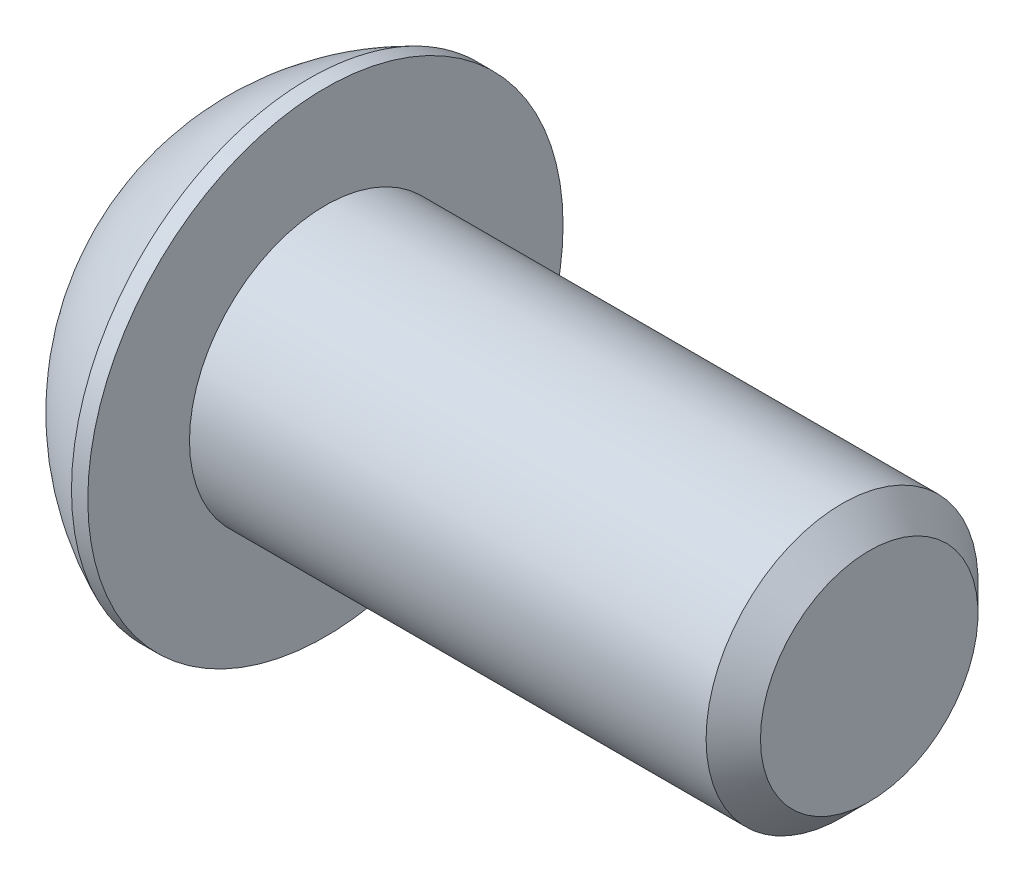
ISO-10303-21;
HEADER;
FILE_DESCRIPTION(('STEP AP214'),'2;1');
FILE_NAME('part.step','',(''),(''),'','','');
FILE_SCHEMA(('AUTOMOTIVE_DESIGN { 1 0 10303 214 1 1 1 1 }'));
ENDSEC;
DATA;
#1=APPLICATION_CONTEXT('core data for automotive mechanical design processes');
#2=APPLICATION_PROTOCOL_DEFINITION('international standard','automotive_design',2000,#1);
#3=PRODUCT_CONTEXT('',#1,'mechanical');
#4=PRODUCT('Part','Part','',(#3));
#5=PRODUCT_RELATED_PRODUCT_CATEGORY('part','',(#4));
#6=PRODUCT_DEFINITION_FORMATION('','',#4);
#7=PRODUCT_DEFINITION_CONTEXT('part definition',#1,'design');
#8=PRODUCT_DEFINITION('design','',#6,#7);
#9=PRODUCT_DEFINITION_SHAPE('','',#8);
#10=(LENGTH_UNIT() NAMED_UNIT(*) SI_UNIT(.MILLI.,.METRE.));
#11=(NAMED_UNIT(*) PLANE_ANGLE_UNIT() SI_UNIT($,.RADIAN.));
#12=(NAMED_UNIT(*) SI_UNIT($,.STERADIAN.) SOLID_ANGLE_UNIT());
#13=UNCERTAINTY_MEASURE_WITH_UNIT(LENGTH_MEASURE(1.E-05),#10,'distance_accuracy_value','');
#14=(GEOMETRIC_REPRESENTATION_CONTEXT(3) GLOBAL_UNCERTAINTY_ASSIGNED_CONTEXT((#13)) GLOBAL_UNIT_ASSIGNED_CONTEXT((#10,
#11,#12)) REPRESENTATION_CONTEXT('',''));
#15=CARTESIAN_POINT('',(0.,0.,0.));
#16=DIRECTION('',(0.,0.,1.));
#17=DIRECTION('',(1.,0.,0.));
#18=AXIS2_PLACEMENT_3D('',#15,#16,#17);
#19=CARTESIAN_POINT('',(1.32080000000034,0.,0.));
#20=DIRECTION('',(-1.,0.,0.));
#21=DIRECTION('',(0.,0.,1.));
#22=AXIS2_PLACEMENT_3D('',#19,#20,#21);
#23=CONICAL_SURFACE('',#22,1.1937999999998,1.04719755119608);
#24=CARTESIAN_POINT('',(2.01004075135902,0.,-4.44089209850063E-13));
#25=VERTEX_POINT('',#24);
#26=VERTEX_LOOP('',#25);
#27=FACE_BOUND('',#26,.T.);
#28=CARTESIAN_POINT('',(1.32080000000009,0.,0.));
#29=DIRECTION('',(-1.,0.,0.));
#30=DIRECTION('',(0.,0.,1.));
#31=AXIS2_PLACEMENT_3D('',#28,#29,#30);
#32=CIRCLE('',#31,1.19380000000024);
#33=CARTESIAN_POINT('',(1.32080000000009,0.,1.19380000000024));
#34=VERTEX_POINT('',#33);
#35=EDGE_CURVE('E21',#34,#34,#32,.T.);
#36=ORIENTED_EDGE('',*,*,#35,.T.);
#37=EDGE_LOOP('',(#36));
#38=FACE_BOUND('',#37,.T.);
#39=ADVANCED_FACE('F18',(#27,#38),#23,.F.);
#40=CARTESIAN_POINT('',(1.3208,-2.29135888084633,0.));
#41=DIRECTION('',(1.,0.,0.));
#42=DIRECTION('',(0.,0.,-1.));
#43=AXIS2_PLACEMENT_3D('',#40,#41,#42);
#44=PLANE('',#43);
#45=DIRECTION('',(0.,1.,0.));
#46=VECTOR('',#45,1.);
#47=CARTESIAN_POINT('',(1.3208,-1.14567944042316,1.984375));
#48=LINE('',#47,#46);
#49=CARTESIAN_POINT('',(1.3208,1.14567944042316,1.984375));
#50=VERTEX_POINT('',#49);
#51=CARTESIAN_POINT('',(1.3208,-1.14567944042316,1.984375));
#52=VERTEX_POINT('',#51);
#53=EDGE_CURVE('E70',#50,#52,#48,.F.);
#54=ORIENTED_EDGE('',*,*,#53,.F.);
#55=DIRECTION('',(0.,0.5,-0.866025403784439));
#56=VECTOR('',#55,1.);
#57=CARTESIAN_POINT('',(1.3208,1.14567944042316,1.984375));
#58=LINE('',#57,#56);
#59=CARTESIAN_POINT('',(1.3208,2.29135888084633,0.));
#60=VERTEX_POINT('',#59);
#61=EDGE_CURVE('E258',#60,#50,#58,.F.);
#62=ORIENTED_EDGE('',*,*,#61,.F.);
#63=DIRECTION('',(0.,-0.5,-0.866025403784439));
#64=VECTOR('',#63,1.);
#65=CARTESIAN_POINT('',(1.3208,2.29135888084633,0.));
#66=LINE('',#65,#64);
#67=CARTESIAN_POINT('',(1.3208,1.14567944042316,-1.984375));
#68=VERTEX_POINT('',#67);
#69=EDGE_CURVE('E262',#68,#60,#66,.F.);
#70=ORIENTED_EDGE('',*,*,#69,.F.);
#71=DIRECTION('',(0.,1.,0.));
#72=VECTOR('',#71,1.);
#73=CARTESIAN_POINT('',(1.3208,1.14567944042316,-1.984375));
#74=LINE('',#73,#72);
#75=CARTESIAN_POINT('',(1.3208,-1.14567944042316,-1.984375));
#76=VERTEX_POINT('',#75);
#77=EDGE_CURVE('E267',#76,#68,#74,.T.);
#78=ORIENTED_EDGE('',*,*,#77,.F.);
#79=DIRECTION('',(0.,-0.500000000000001,0.866025403784438));
#80=VECTOR('',#79,1.);
#81=CARTESIAN_POINT('',(1.3208,-1.14567944042316,-1.984375));
#82=LINE('',#81,#80);
#83=CARTESIAN_POINT('',(1.3208,-2.29135888084633,0.));
#84=VERTEX_POINT('',#83);
#85=EDGE_CURVE('E272',#84,#76,#82,.F.);
#86=ORIENTED_EDGE('',*,*,#85,.F.);
#87=DIRECTION('',(0.,0.500000000000001,0.866025403784438));
#88=VECTOR('',#87,1.);
#89=CARTESIAN_POINT('',(1.3208,-2.29135888084633,0.));
#90=LINE('',#89,#88);
#91=EDGE_CURVE('E83',#52,#84,#90,.F.);
#92=ORIENTED_EDGE('',*,*,#91,.F.);
#93=EDGE_LOOP('',(#54,#62,#70,#78,#86,#92));
#94=FACE_BOUND('',#93,.T.);
#95=ORIENTED_EDGE('',*,*,#35,.F.);
#96=EDGE_LOOP('',(#95));
#97=FACE_BOUND('',#96,.T.);
#98=ADVANCED_FACE('F76',(#94,#97),#44,.F.);
#99=CARTESIAN_POINT('',(1.3208,-1.14567944042316,1.984375));
#100=DIRECTION('',(0.,0.,-1.));
#101=DIRECTION('',(0.,1.,0.));
#102=AXIS2_PLACEMENT_3D('',#99,#100,#101);
#103=PLANE('',#102);
#104=ORIENTED_EDGE('',*,*,#53,.T.);
#105=DIRECTION('',(1.,0.,0.));
#106=VECTOR('',#105,1.);
#107=CARTESIAN_POINT('',(1.3208,-1.14567944042316,1.984375));
#108=LINE('',#107,#106);
#109=CARTESIAN_POINT('',(0.,-1.14567944042316,1.984375));
#110=VERTEX_POINT('',#109);
#111=EDGE_CURVE('E80',#110,#52,#108,.T.);
#112=ORIENTED_EDGE('',*,*,#111,.F.);
#113=DIRECTION('',(0.,1.,0.));
#114=VECTOR('',#113,1.);
#115=CARTESIAN_POINT('',(0.,0.,1.984375));
#116=LINE('',#115,#114);
#117=CARTESIAN_POINT('',(0.,1.14567944042316,1.984375));
#118=VERTEX_POINT('',#117);
#119=EDGE_CURVE('E252',#118,#110,#116,.F.);
#120=ORIENTED_EDGE('',*,*,#119,.F.);
#121=DIRECTION('',(1.,0.,0.));
#122=VECTOR('',#121,1.);
#123=CARTESIAN_POINT('',(1.3208,1.14567944042316,1.984375));
#124=LINE('',#123,#122);
#125=EDGE_CURVE('E255',#50,#118,#124,.F.);
#126=ORIENTED_EDGE('',*,*,#125,.F.);
#127=EDGE_LOOP('',(#104,#112,#120,#126));
#128=FACE_BOUND('',#127,.T.);
#129=ADVANCED_FACE('F129',(#128),#103,.T.);
#130=CARTESIAN_POINT('',(1.3208,-2.29135888084633,0.));
#131=DIRECTION('',(0.,0.866025403784438,-0.500000000000001));
#132=DIRECTION('',(0.,0.500000000000001,0.866025403784438));
#133=AXIS2_PLACEMENT_3D('',#130,#131,#132);
#134=PLANE('',#133);
#135=ORIENTED_EDGE('',*,*,#91,.T.);
#136=DIRECTION('',(1.,0.,0.));
#137=VECTOR('',#136,1.);
#138=CARTESIAN_POINT('',(1.3208,-2.29135888084633,0.));
#139=LINE('',#138,#137);
#140=CARTESIAN_POINT('',(0.,-2.29135888084633,0.));
#141=VERTEX_POINT('',#140);
#142=EDGE_CURVE('E274',#141,#84,#139,.T.);
#143=ORIENTED_EDGE('',*,*,#142,.F.);
#144=DIRECTION('',(0.,-0.500000000000001,-0.866025403784438));
#145=VECTOR('',#144,1.);
#146=CARTESIAN_POINT('',(0.,-1.14567944042316,1.984375));
#147=LINE('',#146,#145);
#148=EDGE_CURVE('E249',#110,#141,#147,.T.);
#149=ORIENTED_EDGE('',*,*,#148,.F.);
#150=ORIENTED_EDGE('',*,*,#111,.T.);
#151=EDGE_LOOP('',(#135,#143,#149,#150));
#152=FACE_BOUND('',#151,.T.);
#153=ADVANCED_FACE('F125',(#152),#134,.T.);
#154=CARTESIAN_POINT('',(1.3208,-1.14567944042316,-1.984375));
#155=DIRECTION('',(0.,0.866025403784438,0.500000000000001));
#156=DIRECTION('',(0.,-0.500000000000001,0.866025403784438));
#157=AXIS2_PLACEMENT_3D('',#154,#155,#156);
#158=PLANE('',#157);
#159=ORIENTED_EDGE('',*,*,#85,.T.);
#160=DIRECTION('',(1.,0.,0.));
#161=VECTOR('',#160,1.);
#162=CARTESIAN_POINT('',(1.3208,-1.14567944042316,-1.984375));
#163=LINE('',#162,#161);
#164=CARTESIAN_POINT('',(0.,-1.14567944042316,-1.984375));
#165=VERTEX_POINT('',#164);
#166=EDGE_CURVE('E269',#165,#76,#163,.T.);
#167=ORIENTED_EDGE('',*,*,#166,.F.);
#168=DIRECTION('',(0.,0.500000000000001,-0.866025403784438));
#169=VECTOR('',#168,1.);
#170=CARTESIAN_POINT('',(0.,-2.29135888084633,0.));
#171=LINE('',#170,#169);
#172=EDGE_CURVE('E246',#141,#165,#171,.T.);
#173=ORIENTED_EDGE('',*,*,#172,.F.);
#174=ORIENTED_EDGE('',*,*,#142,.T.);
#175=EDGE_LOOP('',(#159,#167,#173,#174));
#176=FACE_BOUND('',#175,.T.);
#177=ADVANCED_FACE('F121',(#176),#158,.T.);
#178=CARTESIAN_POINT('',(1.3208,1.14567944042316,-1.984375));
#179=DIRECTION('',(0.,0.,1.));
#180=DIRECTION('',(1.,0.,0.));
#181=AXIS2_PLACEMENT_3D('',#178,#179,#180);
#182=PLANE('',#181);
#183=ORIENTED_EDGE('',*,*,#77,.T.);
#184=DIRECTION('',(1.,0.,0.));
#185=VECTOR('',#184,1.);
#186=CARTESIAN_POINT('',(1.3208,1.14567944042316,-1.984375));
#187=LINE('',#186,#185);
#188=CARTESIAN_POINT('',(0.,1.14567944042316,-1.984375));
#189=VERTEX_POINT('',#188);
#190=EDGE_CURVE('E264',#189,#68,#187,.T.);
#191=ORIENTED_EDGE('',*,*,#190,.F.);
#192=DIRECTION('',(0.,1.,0.));
#193=VECTOR('',#192,1.);
#194=CARTESIAN_POINT('',(0.,0.,-1.984375));
#195=LINE('',#194,#193);
#196=EDGE_CURVE('E243',#165,#189,#195,.T.);
#197=ORIENTED_EDGE('',*,*,#196,.F.);
#198=ORIENTED_EDGE('',*,*,#166,.T.);
#199=EDGE_LOOP('',(#183,#191,#197,#198));
#200=FACE_BOUND('',#199,.T.);
#201=ADVANCED_FACE('F118',(#200),#182,.T.);
#202=CARTESIAN_POINT('',(1.3208,2.29135888084633,0.));
#203=DIRECTION('',(0.,-0.866025403784439,0.5));
#204=DIRECTION('',(0.,-0.5,-0.866025403784439));
#205=AXIS2_PLACEMENT_3D('',#202,#203,#204);
#206=PLANE('',#205);
#207=ORIENTED_EDGE('',*,*,#69,.T.);
#208=DIRECTION('',(1.,0.,0.));
#209=VECTOR('',#208,1.);
#210=CARTESIAN_POINT('',(1.3208,2.29135888084633,0.));
#211=LINE('',#210,#209);
#212=CARTESIAN_POINT('',(0.,2.29135888084633,0.));
#213=VERTEX_POINT('',#212);
#214=EDGE_CURVE('E36',#213,#60,#211,.T.);
#215=ORIENTED_EDGE('',*,*,#214,.F.);
#216=DIRECTION('',(0.,0.5,0.866025403784439));
#217=VECTOR('',#216,1.);
#218=CARTESIAN_POINT('',(0.,1.14567944042316,-1.984375));
#219=LINE('',#218,#217);
#220=EDGE_CURVE('E240',#189,#213,#219,.T.);
#221=ORIENTED_EDGE('',*,*,#220,.F.);
#222=ORIENTED_EDGE('',*,*,#190,.T.);
#223=EDGE_LOOP('',(#207,#215,#221,#222));
#224=FACE_BOUND('',#223,.T.);
#225=ADVANCED_FACE('F114',(#224),#206,.T.);
#226=CARTESIAN_POINT('',(1.3208,1.14567944042316,1.984375));
#227=DIRECTION('',(0.,-0.866025403784439,-0.5));
#228=DIRECTION('',(0.,0.5,-0.866025403784439));
#229=AXIS2_PLACEMENT_3D('',#226,#227,#228);
#230=PLANE('',#229);
#231=ORIENTED_EDGE('',*,*,#61,.T.);
#232=ORIENTED_EDGE('',*,*,#125,.T.);
#233=DIRECTION('',(0.,-0.5,0.866025403784438));
#234=VECTOR('',#233,1.);
#235=CARTESIAN_POINT('',(0.,2.29135888084633,0.));
#236=LINE('',#235,#234);
#237=EDGE_CURVE('E101',#213,#118,#236,.T.);
#238=ORIENTED_EDGE('',*,*,#237,.F.);
#239=ORIENTED_EDGE('',*,*,#214,.T.);
#240=EDGE_LOOP('',(#231,#232,#238,#239));
#241=FACE_BOUND('',#240,.T.);
#242=ADVANCED_FACE('F110',(#241),#230,.T.);
#243=CARTESIAN_POINT('',(0.,0.,0.));
#244=DIRECTION('',(-1.,0.,0.));
#245=DIRECTION('',(0.,0.,1.));
#246=AXIS2_PLACEMENT_3D('',#243,#244,#245);
#247=PLANE('',#246);
#248=ORIENTED_EDGE('',*,*,#220,.T.);
#249=ORIENTED_EDGE('',*,*,#237,.T.);
#250=ORIENTED_EDGE('',*,*,#119,.T.);
#251=ORIENTED_EDGE('',*,*,#148,.T.);
#252=ORIENTED_EDGE('',*,*,#172,.T.);
#253=ORIENTED_EDGE('',*,*,#196,.T.);
#254=EDGE_LOOP('',(#248,#249,#250,#251,#252,#253));
#255=FACE_BOUND('',#254,.T.);
#256=CARTESIAN_POINT('',(0.,2.77495,0.));
#257=CARTESIAN_POINT('',(0.,2.77494953309947,0.0779118937523459));
#258=CARTESIAN_POINT('',(0.,2.77166578388025,0.15583810591977));
#259=CARTESIAN_POINT('',(0.,2.75855213600204,0.311152012455904));
#260=CARTESIAN_POINT('',(0.,2.74872030471467,0.388539541019556));
#261=CARTESIAN_POINT('',(0.,2.72255472645676,0.542341518735717));
#262=CARTESIAN_POINT('',(-2.70414110576258E-13,2.70621065843663,0.618754223567578));
#263=CARTESIAN_POINT('',(2.71501725221868E-13,2.66713326915777,0.769973634286023));
#264=CARTESIAN_POINT('',(1.01274952524446E-12,2.64439476297869,0.844778983646282));
#265=CARTESIAN_POINT('',(1.81909959813207E-12,2.56690195943351,1.06566239301792));
#266=CARTESIAN_POINT('',(4.77081687541822E-13,2.50280672569928,1.20857954243987));
#267=CARTESIAN_POINT('',(-4.76232447128612E-13,2.35149826934097,1.48160874561538));
#268=CARTESIAN_POINT('',(0.,2.26428416790397,1.61172031233499));
#269=CARTESIAN_POINT('',(0.,2.1181093928834,1.79445660654268));
#270=CARTESIAN_POINT('',(0.,2.06678693791626,1.85333128513996));
#271=CARTESIAN_POINT('',(0.,1.95940522984449,1.96650727912792));
#272=CARTESIAN_POINT('',(0.,1.90335059143535,2.02081294920044));
#273=CARTESIAN_POINT('',(0.,1.78683891013963,2.12453280878582));
#274=CARTESIAN_POINT('',(0.,1.72637988450322,2.1739447713554));
#275=CARTESIAN_POINT('',(0.,1.60151968865711,2.26750481692908));
#276=CARTESIAN_POINT('',(0.,1.53711760864537,2.31165167810847));
#277=CARTESIAN_POINT('',(0.,1.33869902291632,2.43567242603944));
#278=CARTESIAN_POINT('',(0.,1.19934704110695,2.507235886628));
#279=CARTESIAN_POINT('',(0.,0.910681609121881,2.62590828672821));
#280=CARTESIAN_POINT('',(0.,0.761368265357398,2.67301748742278));
#281=CARTESIAN_POINT('',(0.,0.456932649466623,2.74151230664007));
#282=CARTESIAN_POINT('',(0.,0.301810346322584,2.76289778778721));
#283=CARTESIAN_POINT('',(0.,-0.00982263870895171,2.77931595661156));
#284=CARTESIAN_POINT('',(0.,-0.166333320596448,2.77434864428877));
#285=CARTESIAN_POINT('',(0.,-0.476280836814452,2.73822217653073));
#286=CARTESIAN_POINT('',(0.,-0.629717687555985,2.70706316096981));
#287=CARTESIAN_POINT('',(0.,-0.929254830044274,2.61937980771149));
#288=CARTESIAN_POINT('',(0.,-1.0753550434132,2.56285519909568));
#289=CARTESIAN_POINT('',(0.,-1.28570692598579,2.46037024128109));
#290=CARTESIAN_POINT('',(0.,-1.35439130022287,2.42323494812896));
#291=CARTESIAN_POINT('',(0.,-1.488391287199,2.34331277270256));
#292=CARTESIAN_POINT('',(0.,-1.55370767631787,2.30052720108831));
#293=CARTESIAN_POINT('',(0.,-1.68047292776594,2.20962421887055));
#294=CARTESIAN_POINT('',(0.,-1.7419235278682,2.16150923122348));
#295=CARTESIAN_POINT('',(0.,-1.86060297067992,2.06024311301283));
#296=CARTESIAN_POINT('',(0.,-1.91782768181715,2.0070871669763));
#297=CARTESIAN_POINT('',(0.,-2.08239462196651,1.8407220856554));
#298=CARTESIAN_POINT('',(0.,-2.18279764272601,1.72049499758422));
#299=CARTESIAN_POINT('',(0.,-2.36195754944063,1.46487629213018));
#300=CARTESIAN_POINT('',(0.,-2.44071525816758,1.32948525142807));
#301=CARTESIAN_POINT('',(0.,-2.54098882695274,1.11796734074395));
#302=CARTESIAN_POINT('',(0.,-2.57146177392727,1.04596540008347));
#303=CARTESIAN_POINT('',(0.,-2.62621251108999,0.899689259475764));
#304=CARTESIAN_POINT('',(0.,-2.65049531495563,0.825416953360952));
#305=CARTESIAN_POINT('',(0.,-2.69267708798766,0.675215808695207));
#306=CARTESIAN_POINT('',(0.,-2.71058613777937,0.599289789313092));
#307=CARTESIAN_POINT('',(0.,-2.73994710360127,0.446213628496932));
#308=CARTESIAN_POINT('',(0.,-2.75140092413871,0.369063855024788));
#309=CARTESIAN_POINT('',(0.,-2.76470470685522,0.24316208817343));
#310=CARTESIAN_POINT('',(0.,-2.76854547596618,0.194611672428577));
#311=CARTESIAN_POINT('',(0.,-2.77366826843264,0.0973760351839812));
#312=CARTESIAN_POINT('',(0.,-2.77495029178814,0.0486908136842395));
#313=CARTESIAN_POINT('',(0.,-2.77494953309947,-0.0779118937523475));
#314=CARTESIAN_POINT('',(0.,-2.77166578388025,-0.155838105919772));
#315=CARTESIAN_POINT('',(0.,-2.75855213600204,-0.311152012455906));
#316=CARTESIAN_POINT('',(0.,-2.74872030471467,-0.388539541019558));
#317=CARTESIAN_POINT('',(0.,-2.72255472645677,-0.542341518735719));
#318=CARTESIAN_POINT('',(-2.70149297926331E-13,-2.70621065843663,-0.61875422356758));
#319=CARTESIAN_POINT('',(2.712366972268E-13,-2.66713326915777,-0.769973634286024));
#320=CARTESIAN_POINT('',(1.0114146773846E-12,-2.64439476297869,-0.844778983646283));
#321=CARTESIAN_POINT('',(1.81656702958366E-12,-2.5669019594335,-1.06566239301792));
#322=CARTESIAN_POINT('',(4.7641829195856E-13,-2.50280672569928,-1.20857954243988));
#323=CARTESIAN_POINT('',(-4.75569026324205E-13,-2.35149826934097,-1.48160874561538));
#324=CARTESIAN_POINT('',(0.,-2.26428416790396,-1.61172031233499));
#325=CARTESIAN_POINT('',(0.,-2.1181093928834,-1.79445660654268));
#326=CARTESIAN_POINT('',(0.,-2.06678693791626,-1.85333128513997));
#327=CARTESIAN_POINT('',(0.,-1.95940522984449,-1.96650727912792));
#328=CARTESIAN_POINT('',(0.,-1.90335059143535,-2.02081294920044));
#329=CARTESIAN_POINT('',(0.,-1.78683891013963,-2.12453280878582));
#330=CARTESIAN_POINT('',(0.,-1.72637988450322,-2.1739447713554));
#331=CARTESIAN_POINT('',(0.,-1.60151968865711,-2.26750481692908));
#332=CARTESIAN_POINT('',(0.,-1.53711760864537,-2.31165167810847));
#333=CARTESIAN_POINT('',(0.,-1.33869902291632,-2.43567242603944));
#334=CARTESIAN_POINT('',(0.,-1.19934704110695,-2.507235886628));
#335=CARTESIAN_POINT('',(0.,-0.91068160912188,-2.62590828672821));
#336=CARTESIAN_POINT('',(0.,-0.761368265357396,-2.67301748742278));
#337=CARTESIAN_POINT('',(0.,-0.456932649466621,-2.74151230664007));
#338=CARTESIAN_POINT('',(0.,-0.301810346322582,-2.76289778778721));
#339=CARTESIAN_POINT('',(0.,0.00982263870895353,-2.77931595661156));
#340=CARTESIAN_POINT('',(0.,0.16633332059645,-2.77434864428876));
#341=CARTESIAN_POINT('',(0.,0.476280836814454,-2.73822217653073));
#342=CARTESIAN_POINT('',(0.,0.629717687555987,-2.70706316096981));
#343=CARTESIAN_POINT('',(0.,0.929254830044276,-2.6193798077115));
#344=CARTESIAN_POINT('',(0.,1.0753550434132,-2.56285519909568));
#345=CARTESIAN_POINT('',(0.,1.28570692598579,-2.46037024128109));
#346=CARTESIAN_POINT('',(0.,1.35439130022287,-2.42323494812896));
#347=CARTESIAN_POINT('',(0.,1.488391287199,-2.34331277270256));
#348=CARTESIAN_POINT('',(0.,1.55370767631787,-2.30052720108831));
#349=CARTESIAN_POINT('',(0.,1.68047292776594,-2.20962421887055));
#350=CARTESIAN_POINT('',(0.,1.7419235278682,-2.16150923122348));
#351=CARTESIAN_POINT('',(0.,1.86060297067992,-2.06024311301282));
#352=CARTESIAN_POINT('',(0.,1.91782768181716,-2.0070871669763));
#353=CARTESIAN_POINT('',(0.,2.08239462196651,-1.8407220856554));
#354=CARTESIAN_POINT('',(0.,2.18279764272601,-1.72049499758422));
#355=CARTESIAN_POINT('',(0.,2.36195754944063,-1.46487629213018));
#356=CARTESIAN_POINT('',(0.,2.44071525816757,-1.32948525142807));
#357=CARTESIAN_POINT('',(0.,2.54098882695273,-1.11796734074395));
#358=CARTESIAN_POINT('',(0.,2.57146177392727,-1.04596540008347));
#359=CARTESIAN_POINT('',(0.,2.62621251108999,-0.899689259475765));
#360=CARTESIAN_POINT('',(0.,2.65049531495563,-0.825416953360953));
#361=CARTESIAN_POINT('',(0.,2.69267708798766,-0.675215808695207));
#362=CARTESIAN_POINT('',(0.,2.71058613777936,-0.599289789313092));
#363=CARTESIAN_POINT('',(0.,2.73994710360127,-0.446213628496932));
#364=CARTESIAN_POINT('',(0.,2.75140092413871,-0.369063855024789));
#365=CARTESIAN_POINT('',(0.,2.76470470685522,-0.243162088173432));
#366=CARTESIAN_POINT('',(0.,2.76854547596618,-0.194611672428578));
#367=CARTESIAN_POINT('',(0.,2.77366826843264,-0.0973760351839823));
#368=CARTESIAN_POINT('',(0.,2.77495029178814,-0.0486908136842408));
#369=CARTESIAN_POINT('',(0.,2.77495,0.));
#370=B_SPLINE_CURVE_WITH_KNOTS('',3,(#256,#257,#258,#259,#260,#261,#262,#263,#264,#265,#266,
#267,#268,#269,#270,#271,#272,#273,#274,#275,#276,#277,#278,#279,#280,#281,#282,#283,#284,#285,
#286,#287,#288,#289,#290,#291,#292,#293,#294,#295,#296,#297,#298,#299,#300,#301,#302,#303,#304,
#305,#306,#307,#308,#309,#310,#311,#312,#313,#314,#315,#316,#317,#318,#319,#320,#321,#322,#323,
#324,#325,#326,#327,#328,#329,#330,#331,#332,#333,#334,#335,#336,#337,#338,#339,#340,#341,#342,
#343,#344,#345,#346,#347,#348,#349,#350,#351,#352,#353,#354,#355,#356,#357,#358,#359,#360,#361,
#362,#363,#364,#365,#366,#367,#368,#369),.UNSPECIFIED.,.T.,.F.,(4,2,2,2,2,2,2,2,2,2,2,2,2,2,2,2,
2,2,2,2,2,2,2,2,2,2,2,2,2,2,2,2,2,2,2,2,2,2,2,2,2,2,2,2,2,2,2,2,2,2,2,2,2,2,2,2,4),(0.,
0.233690856748162,0.467450716578751,0.701582538521471,0.935904756015414,1.40343220467667,
1.87097742791502,2.10505636898837,2.33890962270652,2.57286880998746,2.80688218486306,
3.27442101763127,3.74195485676357,4.20949119271389,4.67702752866417,5.14456136779641,
5.61210020056468,5.84611357544033,6.08007276272136,6.31392601643949,6.54800495751273,
7.01555018075072,7.48307762941212,7.71739984690652,7.95153166884955,8.18529152868023,
8.41898238542855,8.56502681353347,8.71107124163843,8.94476209838659,9.17852195821718,
9.4126537801599,9.64697599765384,10.1145034463151,10.5820486695534,10.8161276106268,
11.0499808643449,11.2839400516259,11.5179534265015,11.9854922592697,12.453026098402,
12.9205624343523,13.3880987703026,13.8556326094348,14.3231714422031,14.5571848170788,
14.7911440043598,15.0249972580779,15.2590761991512,15.7266214223891,16.1941488710506,
16.4284710885449,16.662602910488,16.8963627703186,17.130053627067,17.2760980551719,
17.4221424832769),.UNSPECIFIED.);
#371=CARTESIAN_POINT('',(0.,2.77495,0.));
#372=VERTEX_POINT('',#371);
#373=EDGE_CURVE('E95',#372,#372,#370,.T.);
#374=ORIENTED_EDGE('',*,*,#373,.F.);
#375=EDGE_LOOP('',(#374));
#376=FACE_BOUND('',#375,.T.);
#377=ADVANCED_FACE('F106',(#255,#376),#247,.T.);
#378=CARTESIAN_POINT('',(5.37260881410256,0.,0.));
#379=DIRECTION('',(0.,1.,0.));
#380=DIRECTION('',(1.,0.,0.));
#381=AXIS2_PLACEMENT_3D('',#378,#379,#380);
#382=SPHERICAL_SURFACE('',#381,6.04692260342999);
#383=CARTESIAN_POINT('',(2.9718,0.,0.));
#384=DIRECTION('',(-1.,0.,0.));
#385=DIRECTION('',(0.,0.,1.));
#386=AXIS2_PLACEMENT_3D('',#383,#384,#385);
#387=CIRCLE('',#386,5.5499);
#388=CARTESIAN_POINT('',(2.9718,0.,5.5499));
#389=VERTEX_POINT('',#388);
#390=EDGE_CURVE('E93',#389,#389,#387,.F.);
#391=ORIENTED_EDGE('',*,*,#390,.F.);
#392=EDGE_LOOP('',(#391));
#393=FACE_BOUND('',#392,.T.);
#394=ORIENTED_EDGE('',*,*,#373,.T.);
#395=EDGE_LOOP('',(#394));
#396=FACE_BOUND('',#395,.T.);
#397=ADVANCED_FACE('F102',(#393,#396),#382,.T.);
#398=CARTESIAN_POINT('',(16.0528,0.,0.));
#399=DIRECTION('',(-1.,0.,0.));
#400=DIRECTION('',(0.,0.,1.));
#401=AXIS2_PLACEMENT_3D('',#398,#399,#400);
#402=PLANE('',#401);
#403=CARTESIAN_POINT('',(16.0528000000681,0.,0.));
#404=DIRECTION('',(-1.,0.,0.));
#405=DIRECTION('',(0.,0.,1.));
#406=AXIS2_PLACEMENT_3D('',#403,#404,#405);
#407=CIRCLE('',#406,2.54000000001042);
#408=CARTESIAN_POINT('',(16.0528000000681,0.,2.54000000001042));
#409=VERTEX_POINT('',#408);
#410=EDGE_CURVE('E90',#409,#409,#407,.T.);
#411=ORIENTED_EDGE('',*,*,#410,.F.);
#412=EDGE_LOOP('',(#411));
#413=FACE_BOUND('',#412,.T.);
#414=ADVANCED_FACE('F155',(#413),#402,.F.);
#415=CARTESIAN_POINT('',(0.,0.,0.));
#416=DIRECTION('',(-1.,0.,0.));
#417=DIRECTION('',(0.,0.,1.));
#418=AXIS2_PLACEMENT_3D('',#415,#416,#417);
#419=CYLINDRICAL_SURFACE('',#418,5.5499);
#420=ORIENTED_EDGE('',*,*,#390,.T.);
#421=EDGE_LOOP('',(#420));
#422=FACE_BOUND('',#421,.T.);
#423=CARTESIAN_POINT('',(3.3528,0.,0.));
#424=DIRECTION('',(-1.,0.,0.));
#425=DIRECTION('',(0.,0.,1.));
#426=AXIS2_PLACEMENT_3D('',#423,#424,#425);
#427=CIRCLE('',#426,5.5499);
#428=CARTESIAN_POINT('',(3.3528,0.,5.5499));
#429=VERTEX_POINT('',#428);
#430=EDGE_CURVE('E87',#429,#429,#427,.T.);
#431=ORIENTED_EDGE('',*,*,#430,.T.);
#432=EDGE_LOOP('',(#431));
#433=FACE_BOUND('',#432,.T.);
#434=ADVANCED_FACE('F152',(#422,#433),#419,.T.);
#435=CARTESIAN_POINT('',(15.4178000000229,0.,0.));
#436=DIRECTION('',(-1.,0.,0.));
#437=DIRECTION('',(0.,0.,1.));
#438=AXIS2_PLACEMENT_3D('',#435,#436,#437);
#439=CONICAL_SURFACE('',#438,3.17500000005566,0.785398163397448);
#440=CARTESIAN_POINT('',(15.4178,0.,0.));
#441=DIRECTION('',(-1.,0.,0.));
#442=DIRECTION('',(0.,0.,1.));
#443=AXIS2_PLACEMENT_3D('',#440,#441,#442);
#444=CIRCLE('',#443,3.175);
#445=CARTESIAN_POINT('',(15.4178,0.,3.175));
#446=VERTEX_POINT('',#445);
#447=EDGE_CURVE('E27',#446,#446,#444,.T.);
#448=ORIENTED_EDGE('',*,*,#447,.F.);
#449=EDGE_LOOP('',(#448));
#450=FACE_BOUND('',#449,.T.);
#451=ORIENTED_EDGE('',*,*,#410,.T.);
#452=EDGE_LOOP('',(#451));
#453=FACE_BOUND('',#452,.T.);
#454=ADVANCED_FACE('F145',(#450,#453),#439,.T.);
#455=CARTESIAN_POINT('',(3.3528,3.175,0.));
#456=DIRECTION('',(-1.,0.,0.));
#457=DIRECTION('',(0.,0.,1.));
#458=AXIS2_PLACEMENT_3D('',#455,#456,#457);
#459=PLANE('',#458);
#460=CARTESIAN_POINT('',(3.3528,0.,0.));
#461=DIRECTION('',(-1.,0.,0.));
#462=DIRECTION('',(0.,0.,1.));
#463=AXIS2_PLACEMENT_3D('',#460,#461,#462);
#464=CIRCLE('',#463,3.175);
#465=CARTESIAN_POINT('',(3.3528,0.,3.175));
#466=VERTEX_POINT('',#465);
#467=EDGE_CURVE('E11',#466,#466,#464,.F.);
#468=ORIENTED_EDGE('',*,*,#467,.F.);
#469=EDGE_LOOP('',(#468));
#470=FACE_BOUND('',#469,.T.);
#471=ORIENTED_EDGE('',*,*,#430,.F.);
#472=EDGE_LOOP('',(#471));
#473=FACE_BOUND('',#472,.T.);
#474=ADVANCED_FACE('F139',(#470,#473),#459,.F.);
#475=CARTESIAN_POINT('',(0.,0.,0.));
#476=DIRECTION('',(-1.,0.,0.));
#477=DIRECTION('',(0.,0.,1.));
#478=AXIS2_PLACEMENT_3D('',#475,#476,#477);
#479=CYLINDRICAL_SURFACE('',#478,3.175);
#480=ORIENTED_EDGE('',*,*,#467,.T.);
#481=EDGE_LOOP('',(#480));
#482=FACE_BOUND('',#481,.T.);
#483=ORIENTED_EDGE('',*,*,#447,.T.);
#484=EDGE_LOOP('',(#483));
#485=FACE_BOUND('',#484,.T.);
#486=ADVANCED_FACE('F137',(#482,#485),#479,.T.);
#487=CLOSED_SHELL('',(#39,#98,#129,#153,#177,#201,#225,#242,#377,#397,#414,#434,#454,#474,#486));
#488=MANIFOLD_SOLID_BREP('B1',#487);
#489=ADVANCED_BREP_SHAPE_REPRESENTATION('',(#18,#488),#14);
#490=SHAPE_DEFINITION_REPRESENTATION(#9,#489);
ENDSEC;
END-ISO-10303-21;
